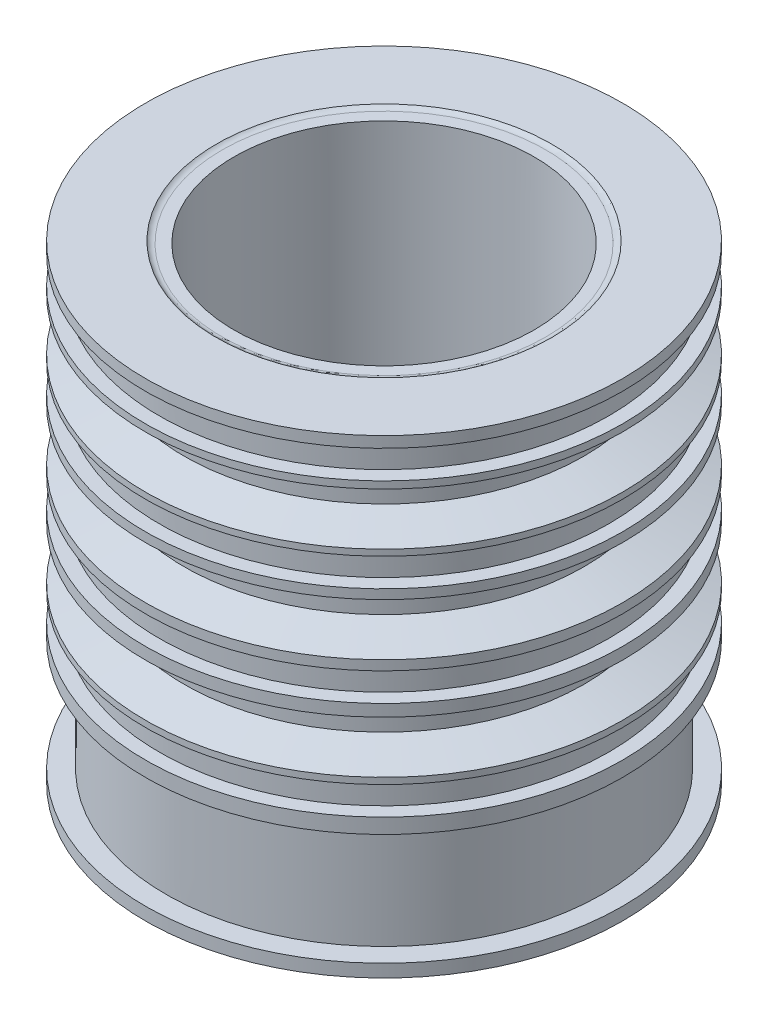
ISO-10303-21;
HEADER;
FILE_DESCRIPTION(('STEP AP214'),'2;1');
FILE_NAME('part.step','',(''),(''),'','','');
FILE_SCHEMA(('AUTOMOTIVE_DESIGN { 1 0 10303 214 1 1 1 1 }'));
ENDSEC;
DATA;
#1=APPLICATION_CONTEXT('core data for automotive mechanical design processes');
#2=APPLICATION_PROTOCOL_DEFINITION('international standard','automotive_design',2000,#1);
#3=PRODUCT_CONTEXT('',#1,'mechanical');
#4=PRODUCT('Part','Part','',(#3));
#5=PRODUCT_RELATED_PRODUCT_CATEGORY('part','',(#4));
#6=PRODUCT_DEFINITION_FORMATION('','',#4);
#7=PRODUCT_DEFINITION_CONTEXT('part definition',#1,'design');
#8=PRODUCT_DEFINITION('design','',#6,#7);
#9=PRODUCT_DEFINITION_SHAPE('','',#8);
#10=(LENGTH_UNIT() NAMED_UNIT(*) SI_UNIT(.MILLI.,.METRE.));
#11=(NAMED_UNIT(*) PLANE_ANGLE_UNIT() SI_UNIT($,.RADIAN.));
#12=(NAMED_UNIT(*) SI_UNIT($,.STERADIAN.) SOLID_ANGLE_UNIT());
#13=UNCERTAINTY_MEASURE_WITH_UNIT(LENGTH_MEASURE(1.E-05),#10,'distance_accuracy_value','');
#14=(GEOMETRIC_REPRESENTATION_CONTEXT(3) GLOBAL_UNCERTAINTY_ASSIGNED_CONTEXT((#13)) GLOBAL_UNIT_ASSIGNED_CONTEXT((#10,
#11,#12)) REPRESENTATION_CONTEXT('',''));
#15=CARTESIAN_POINT('',(0.,0.,0.));
#16=DIRECTION('',(0.,0.,1.));
#17=DIRECTION('',(1.,0.,0.));
#18=AXIS2_PLACEMENT_3D('',#15,#16,#17);
#19=CARTESIAN_POINT('',(-0.0016509550356137,33.7699254257973,0.));
#20=DIRECTION('',(-4.8888323347601E-05,0.999999998804966,0.));
#21=DIRECTION('',(-0.999999998804966,-4.8888323347601E-05,0.));
#22=AXIS2_PLACEMENT_3D('',#19,#20,#21);
#23=CONICAL_SURFACE('',#22,11.6987065389935,1.57074743844616);
#24=CARTESIAN_POINT('',(-0.00165095298483923,33.7698834776525,0.));
#25=DIRECTION('',(4.8888323347601E-05,-0.999999998804966,0.));
#26=DIRECTION('',(0.999999998804966,4.8888323347601E-05,0.));
#27=AXIS2_PLACEMENT_3D('',#24,#25,#26);
#28=CIRCLE('',#27,10.8406668230212);
#29=CARTESIAN_POINT('',(10.8390158570814,33.7704134596774,0.));
#30=VERTEX_POINT('',#29);
#31=EDGE_CURVE('E10',#30,#30,#28,.T.);
#32=ORIENTED_EDGE('',*,*,#31,.T.);
#33=EDGE_LOOP('',(#32));
#34=FACE_BOUND('',#33,.T.);
#35=CARTESIAN_POINT('',(-0.0016509550356137,33.7699254257973,0.));
#36=DIRECTION('',(4.8888323347601E-05,-0.999999998804966,0.));
#37=DIRECTION('',(0.999999998804966,4.8888323347601E-05,0.));
#38=AXIS2_PLACEMENT_3D('',#35,#36,#37);
#39=CIRCLE('',#38,11.6987065389935);
#40=CARTESIAN_POINT('',(11.6970555699776,33.7704973559454,0.));
#41=VERTEX_POINT('',#40);
#42=EDGE_CURVE('E160',#41,#41,#39,.T.);
#43=ORIENTED_EDGE('',*,*,#42,.F.);
#44=EDGE_LOOP('',(#43));
#45=FACE_BOUND('',#44,.T.);
#46=ADVANCED_FACE('F30',(#34,#45),#23,.F.);
#47=CARTESIAN_POINT('',(-0.00165095298483923,33.7698834776525,0.));
#48=DIRECTION('',(4.8888323347601E-05,-0.999999998804966,0.));
#49=DIRECTION('',(0.999999998804966,4.8888323347601E-05,0.));
#50=AXIS2_PLACEMENT_3D('',#47,#48,#49);
#51=CONICAL_SURFACE('',#50,10.8406668230212,4.88883233667293E-05);
#52=CARTESIAN_POINT('',(-0.000477459896761109,9.76633812527663,0.));
#53=DIRECTION('',(4.8888323347601E-05,-0.999999998804966,0.));
#54=DIRECTION('',(0.999999998804966,4.8888323347601E-05,0.));
#55=AXIS2_PLACEMENT_3D('',#52,#53,#54);
#56=CIRCLE('',#55,10.8418403161107);
#57=CARTESIAN_POINT('',(10.8413628432576,9.76686816467169,0.));
#58=VERTEX_POINT('',#57);
#59=EDGE_CURVE('E36',#58,#58,#56,.T.);
#60=ORIENTED_EDGE('',*,*,#59,.T.);
#61=EDGE_LOOP('',(#60));
#62=FACE_BOUND('',#61,.T.);
#63=ORIENTED_EDGE('',*,*,#31,.F.);
#64=EDGE_LOOP('',(#63));
#65=FACE_BOUND('',#64,.T.);
#66=ADVANCED_FACE('F168',(#62,#65),#51,.F.);
#67=CARTESIAN_POINT('',(-0.000463950211009728,9.49000044767884,0.));
#68=DIRECTION('',(4.8888323347601E-05,-0.999999998804966,0.));
#69=DIRECTION('',(0.999999998804966,4.8888323347601E-05,0.));
#70=AXIS2_PLACEMENT_3D('',#67,#68,#69);
#71=TOROIDAL_SURFACE('',#70,10.2632570925746,0.641187226011283);
#72=CARTESIAN_POINT('',(-0.000455579930538189,9.31878818495237,0.));
#73=DIRECTION('',(4.8888323347601E-05,-0.999999998804966,0.));
#74=DIRECTION('',(0.999999998804966,4.8888323347601E-05,0.));
#75=AXIS2_PLACEMENT_3D('',#72,#73,#74);
#76=CIRCLE('',#75,10.8811627648435);
#77=CARTESIAN_POINT('',(10.8807071719096,9.31932014675602,0.));
#78=VERTEX_POINT('',#77);
#79=EDGE_CURVE('E40',#78,#78,#76,.T.);
#80=ORIENTED_EDGE('',*,*,#79,.T.);
#81=EDGE_LOOP('',(#80));
#82=FACE_BOUND('',#81,.T.);
#83=ORIENTED_EDGE('',*,*,#59,.F.);
#84=EDGE_LOOP('',(#83));
#85=FACE_BOUND('',#84,.T.);
#86=ADVANCED_FACE('F172',(#82,#85),#71,.F.);
#87=CARTESIAN_POINT('',(-0.000455579930538189,9.31878818495237,0.));
#88=DIRECTION('',(-4.8888323347601E-05,0.999999998804966,0.));
#89=DIRECTION('',(-0.999999998804966,-4.8888323347601E-05,0.));
#90=AXIS2_PLACEMENT_3D('',#87,#88,#89);
#91=CONICAL_SURFACE('',#90,10.8811627648435,0.000755615516415063);
#92=CARTESIAN_POINT('',(-0.000348856109653507,7.13577568934424,0.));
#93=DIRECTION('',(4.8888323347601E-05,-0.999999998804966,0.));
#94=DIRECTION('',(0.999999998804966,4.8888323347601E-05,0.));
#95=AXIS2_PLACEMENT_3D('',#92,#93,#94);
#96=CIRCLE('',#95,10.8795132464134);
#97=CARTESIAN_POINT('',(10.8791643773024,7.1363075705057,0.));
#98=VERTEX_POINT('',#97);
#99=EDGE_CURVE('E44',#98,#98,#96,.T.);
#100=ORIENTED_EDGE('',*,*,#99,.T.);
#101=EDGE_LOOP('',(#100));
#102=FACE_BOUND('',#101,.T.);
#103=ORIENTED_EDGE('',*,*,#79,.F.);
#104=EDGE_LOOP('',(#103));
#105=FACE_BOUND('',#104,.T.);
#106=ADVANCED_FACE('F176',(#102,#105),#91,.F.);
#107=CARTESIAN_POINT('',(-0.000348856109653507,7.13577568934424,0.));
#108=DIRECTION('',(4.8888323347601E-05,-0.999999998804966,0.));
#109=DIRECTION('',(0.999999998804966,4.8888323347601E-05,0.));
#110=AXIS2_PLACEMENT_3D('',#107,#108,#109);
#111=CONICAL_SURFACE('',#110,10.8795132464134,1.41021445256014);
#112=CARTESIAN_POINT('',(-0.00033397194410014,6.83132332697231,0.));
#113=DIRECTION('',(4.8888323347601E-05,-0.999999998804966,0.));
#114=DIRECTION('',(0.999999998804966,4.8888323347601E-05,0.));
#115=AXIS2_PLACEMENT_3D('',#112,#113,#114);
#116=CIRCLE('',#115,12.7591209553291);
#117=CARTESIAN_POINT('',(12.7587869681374,6.8319470990032,0.));
#118=VERTEX_POINT('',#117);
#119=EDGE_CURVE('E49',#118,#118,#116,.T.);
#120=ORIENTED_EDGE('',*,*,#119,.T.);
#121=EDGE_LOOP('',(#120));
#122=FACE_BOUND('',#121,.T.);
#123=ORIENTED_EDGE('',*,*,#99,.F.);
#124=EDGE_LOOP('',(#123));
#125=FACE_BOUND('',#124,.T.);
#126=ADVANCED_FACE('F183',(#122,#125),#111,.F.);
#127=CARTESIAN_POINT('',(-0.00033397194410014,6.83132332697231,0.));
#128=DIRECTION('',(4.8888323347601E-05,-0.999999998804966,0.));
#129=DIRECTION('',(0.999999998804966,4.8888323347601E-05,0.));
#130=AXIS2_PLACEMENT_3D('',#127,#128,#129);
#131=CONICAL_SURFACE('',#130,12.7591209553291,4.88883180863904E-05);
#132=CARTESIAN_POINT('',(0.,-3.64228613807057E-13,0.));
#133=DIRECTION('',(4.8888323347601E-05,-0.999999998804966,0.));
#134=DIRECTION('',(0.999999998804966,4.8888323347601E-05,0.));
#135=AXIS2_PLACEMENT_3D('',#132,#133,#134);
#136=CIRCLE('',#135,12.7594549272375);
#137=CARTESIAN_POINT('',(12.7594549119895,0.000623788357857698,0.));
#138=VERTEX_POINT('',#137);
#139=EDGE_CURVE('E52',#138,#138,#136,.T.);
#140=ORIENTED_EDGE('',*,*,#139,.T.);
#141=EDGE_LOOP('',(#140));
#142=FACE_BOUND('',#141,.T.);
#143=ORIENTED_EDGE('',*,*,#119,.F.);
#144=EDGE_LOOP('',(#143));
#145=FACE_BOUND('',#144,.T.);
#146=ADVANCED_FACE('F187',(#142,#145),#131,.F.);
#147=CARTESIAN_POINT('',(0.,-3.64228613807057E-13,0.));
#148=DIRECTION('',(-4.8888323347601E-05,0.999999998804966,0.));
#149=DIRECTION('',(-0.999999998804966,-4.8888323347601E-05,0.));
#150=AXIS2_PLACEMENT_3D('',#147,#148,#149);
#151=CONICAL_SURFACE('',#150,12.7594549272375,1.57074743846375);
#152=CARTESIAN_POINT('',(-1.07049960643249E-08,0.000218968361328704,0.));
#153=DIRECTION('',(4.8888323347601E-05,-0.999999998804966,0.));
#154=DIRECTION('',(0.999999998804966,4.8888323347601E-05,0.));
#155=AXIS2_PLACEMENT_3D('',#152,#153,#154);
#156=CIRCLE('',#155,17.2384043334826);
#157=CARTESIAN_POINT('',(17.2384043021772,0.00106172504638069,0.));
#158=VERTEX_POINT('',#157);
#159=EDGE_CURVE('E55',#158,#158,#156,.T.);
#160=ORIENTED_EDGE('',*,*,#159,.T.);
#161=EDGE_LOOP('',(#160));
#162=FACE_BOUND('',#161,.T.);
#163=ORIENTED_EDGE('',*,*,#139,.F.);
#164=EDGE_LOOP('',(#163));
#165=FACE_BOUND('',#164,.T.);
#166=ADVANCED_FACE('F191',(#162,#165),#151,.T.);
#167=CARTESIAN_POINT('',(-1.07049960643249E-08,0.000218968361328704,0.));
#168=DIRECTION('',(4.8888323347601E-05,-0.999999998804966,0.));
#169=DIRECTION('',(0.999999998804966,4.8888323347601E-05,0.));
#170=AXIS2_PLACEMENT_3D('',#167,#168,#169);
#171=CONICAL_SURFACE('',#170,17.2384043334826,4.88883585371672E-05);
#172=CARTESIAN_POINT('',(-4.53166192771179E-05,0.926941570500528,0.));
#173=DIRECTION('',(4.8888323347601E-05,-0.999999998804966,0.));
#174=DIRECTION('',(0.999999998804966,4.8888323347601E-05,0.));
#175=AXIS2_PLACEMENT_3D('',#172,#173,#174);
#176=CIRCLE('',#175,17.2383590275357);
#177=CARTESIAN_POINT('',(17.238313690316,0.927784324970649,0.));
#178=VERTEX_POINT('',#177);
#179=EDGE_CURVE('E58',#178,#178,#176,.T.);
#180=ORIENTED_EDGE('',*,*,#179,.T.);
#181=EDGE_LOOP('',(#180));
#182=FACE_BOUND('',#181,.T.);
#183=ORIENTED_EDGE('',*,*,#159,.F.);
#184=EDGE_LOOP('',(#183));
#185=FACE_BOUND('',#184,.T.);
#186=ADVANCED_FACE('F195',(#182,#185),#171,.T.);
#187=CARTESIAN_POINT('',(-4.53166192771179E-05,0.926941570500528,0.));
#188=DIRECTION('',(-4.8888323347601E-05,0.999999998804966,0.));
#189=DIRECTION('',(-0.999999998804966,-4.8888323347601E-05,0.));
#190=AXIS2_PLACEMENT_3D('',#187,#188,#189);
#191=CONICAL_SURFACE('',#190,17.2383590275357,1.57074743846887);
#192=CARTESIAN_POINT('',(-4.53130823744777E-05,0.926869223927896,0.));
#193=DIRECTION('',(4.8888323347601E-05,-0.999999998804966,0.));
#194=DIRECTION('',(0.999999998804966,4.8888323347601E-05,0.));
#195=AXIS2_PLACEMENT_3D('',#192,#193,#194);
#196=CIRCLE('',#195,15.7585257310919);
#197=CARTESIAN_POINT('',(15.7584803991775,0.927639631829319,0.));
#198=VERTEX_POINT('',#197);
#199=EDGE_CURVE('E61',#198,#198,#196,.T.);
#200=ORIENTED_EDGE('',*,*,#199,.T.);
#201=EDGE_LOOP('',(#200));
#202=FACE_BOUND('',#201,.T.);
#203=ORIENTED_EDGE('',*,*,#179,.F.);
#204=EDGE_LOOP('',(#203));
#205=FACE_BOUND('',#204,.T.);
#206=ADVANCED_FACE('F199',(#202,#205),#191,.F.);
#207=CARTESIAN_POINT('',(-4.53130823744777E-05,0.926869223927896,0.));
#208=DIRECTION('',(-4.8888323347601E-05,0.999999998804966,0.));
#209=DIRECTION('',(-0.999999998804966,-4.8888323347601E-05,0.));
#210=AXIS2_PLACEMENT_3D('',#207,#208,#209);
#211=CONICAL_SURFACE('',#210,15.7585257310919,0.000561303075088053);
#212=CARTESIAN_POINT('',(-0.000439011716176201,8.97988897124061,0.));
#213=DIRECTION('',(4.8888323347601E-05,-0.999999998804966,0.));
#214=DIRECTION('',(0.999999998804966,4.8888323347601E-05,0.));
#215=AXIS2_PLACEMENT_3D('',#212,#213,#214);
#216=CIRCLE('',#215,15.7630459163199);
#217=CARTESIAN_POINT('',(15.7626068857663,8.98065960012631,0.));
#218=VERTEX_POINT('',#217);
#219=EDGE_CURVE('E64',#218,#218,#216,.T.);
#220=ORIENTED_EDGE('',*,*,#219,.T.);
#221=EDGE_LOOP('',(#220));
#222=FACE_BOUND('',#221,.T.);
#223=ORIENTED_EDGE('',*,*,#199,.F.);
#224=EDGE_LOOP('',(#223));
#225=FACE_BOUND('',#224,.T.);
#226=ADVANCED_FACE('F203',(#222,#225),#211,.T.);
#227=CARTESIAN_POINT('',(-0.000439011716176201,8.97988897124061,0.));
#228=DIRECTION('',(-4.8888323347601E-05,0.999999998804966,0.));
#229=DIRECTION('',(-0.999999998804966,-4.8888323347601E-05,0.));
#230=AXIS2_PLACEMENT_3D('',#227,#228,#229);
#231=CONICAL_SURFACE('',#230,15.7630459163199,1.5707474385034);
#232=CARTESIAN_POINT('',(-0.000439015241331834,8.97996107753077,0.));
#233=DIRECTION('',(4.8888323347601E-05,-0.999999998804966,0.));
#234=DIRECTION('',(0.999999998804966,4.8888323347601E-05,0.));
#235=AXIS2_PLACEMENT_3D('',#232,#233,#234);
#236=CIRCLE('',#235,17.2379653289458);
#237=CARTESIAN_POINT('',(17.2375262931045,8.98080381275362,0.));
#238=VERTEX_POINT('',#237);
#239=EDGE_CURVE('E67',#238,#238,#236,.T.);
#240=ORIENTED_EDGE('',*,*,#239,.T.);
#241=EDGE_LOOP('',(#240));
#242=FACE_BOUND('',#241,.T.);
#243=ORIENTED_EDGE('',*,*,#219,.F.);
#244=EDGE_LOOP('',(#243));
#245=FACE_BOUND('',#244,.T.);
#246=ADVANCED_FACE('F207',(#242,#245),#231,.T.);
#247=CARTESIAN_POINT('',(-0.000439015241331834,8.97996107753077,0.));
#248=DIRECTION('',(4.8888323347601E-05,-0.999999998804966,0.));
#249=DIRECTION('',(0.999999998804966,4.8888323347601E-05,0.));
#250=AXIS2_PLACEMENT_3D('',#247,#248,#249);
#251=CONICAL_SURFACE('',#250,17.2379653289458,4.88884486765176E-05);
#252=CARTESIAN_POINT('',(-0.000492154887899934,10.0669209662299,0.));
#253=DIRECTION('',(4.8888323347601E-05,-0.999999998804966,0.));
#254=DIRECTION('',(0.999999998804966,4.8888323347601E-05,0.));
#255=AXIS2_PLACEMENT_3D('',#252,#253,#254);
#256=CIRCLE('',#255,17.2379121891629);
#257=CARTESIAN_POINT('',(17.2374200136751,10.0677636988548,0.));
#258=VERTEX_POINT('',#257);
#259=EDGE_CURVE('E70',#258,#258,#256,.T.);
#260=ORIENTED_EDGE('',*,*,#259,.T.);
#261=EDGE_LOOP('',(#260));
#262=FACE_BOUND('',#261,.T.);
#263=ORIENTED_EDGE('',*,*,#239,.F.);
#264=EDGE_LOOP('',(#263));
#265=FACE_BOUND('',#264,.T.);
#266=ADVANCED_FACE('F211',(#262,#265),#251,.T.);
#267=CARTESIAN_POINT('',(-0.000492154887899934,10.0669209662299,0.));
#268=DIRECTION('',(-4.8888323347601E-05,0.999999998804966,0.));
#269=DIRECTION('',(-0.999999998804966,-4.8888323347601E-05,0.));
#270=AXIS2_PLACEMENT_3D('',#267,#268,#269);
#271=CONICAL_SURFACE('',#270,17.2379121891629,1.5707474385081);
#272=CARTESIAN_POINT('',(-0.000492152507184025,10.0668722692049,0.));
#273=DIRECTION('',(4.8888323347601E-05,-0.999999998804966,0.));
#274=DIRECTION('',(0.999999998804966,4.8888323347601E-05,0.));
#275=AXIS2_PLACEMENT_3D('',#272,#273,#274);
#276=CIRCLE('',#275,16.241824409583);
#277=CARTESIAN_POINT('',(16.2413322376663,10.0676663047684,0.));
#278=VERTEX_POINT('',#277);
#279=EDGE_CURVE('E73',#278,#278,#276,.T.);
#280=ORIENTED_EDGE('',*,*,#279,.T.);
#281=EDGE_LOOP('',(#280));
#282=FACE_BOUND('',#281,.T.);
#283=ORIENTED_EDGE('',*,*,#259,.F.);
#284=EDGE_LOOP('',(#283));
#285=FACE_BOUND('',#284,.T.);
#286=ADVANCED_FACE('F215',(#282,#285),#271,.F.);
#287=CARTESIAN_POINT('',(-0.000492152507184025,10.0668722692049,0.));
#288=DIRECTION('',(4.8888323347601E-05,-0.999999998804966,0.));
#289=DIRECTION('',(0.999999998804966,4.8888323347601E-05,0.));
#290=AXIS2_PLACEMENT_3D('',#287,#288,#289);
#291=CONICAL_SURFACE('',#290,16.241824409583,4.88883417639845E-05);
#292=CARTESIAN_POINT('',(-0.000591694588467061,12.1029838465303,0.));
#293=DIRECTION('',(4.8888323347601E-05,-0.999999998804966,0.));
#294=DIRECTION('',(0.999999998804966,4.8888323347601E-05,0.));
#295=AXIS2_PLACEMENT_3D('',#292,#293,#294);
#296=CIRCLE('',#295,16.2417248674642);
#297=CARTESIAN_POINT('',(16.2411331534663,12.1037778772274,0.));
#298=VERTEX_POINT('',#297);
#299=EDGE_CURVE('E76',#298,#298,#296,.T.);
#300=ORIENTED_EDGE('',*,*,#299,.T.);
#301=EDGE_LOOP('',(#300));
#302=FACE_BOUND('',#301,.T.);
#303=ORIENTED_EDGE('',*,*,#279,.F.);
#304=EDGE_LOOP('',(#303));
#305=FACE_BOUND('',#304,.T.);
#306=ADVANCED_FACE('F219',(#302,#305),#291,.T.);
#307=CARTESIAN_POINT('',(-0.000591694588467061,12.1029838465303,0.));
#308=DIRECTION('',(-4.8888323347601E-05,0.999999998804966,0.));
#309=DIRECTION('',(-0.999999998804966,-4.8888323347601E-05,0.));
#310=AXIS2_PLACEMENT_3D('',#307,#308,#309);
#311=CONICAL_SURFACE('',#310,16.2417248674642,1.57074743844369);
#312=CARTESIAN_POINT('',(-0.000591696969186106,12.1030325436195,0.));
#313=DIRECTION('',(4.8888323347601E-05,-0.999999998804966,0.));
#314=DIRECTION('',(0.999999998804966,4.8888323347601E-05,0.));
#315=AXIS2_PLACEMENT_3D('',#312,#313,#314);
#316=CIRCLE('',#315,17.2378126472177);
#317=CARTESIAN_POINT('',(17.2372209296488,12.103875271378,0.));
#318=VERTEX_POINT('',#317);
#319=EDGE_CURVE('E79',#318,#318,#316,.T.);
#320=ORIENTED_EDGE('',*,*,#319,.T.);
#321=EDGE_LOOP('',(#320));
#322=FACE_BOUND('',#321,.T.);
#323=ORIENTED_EDGE('',*,*,#299,.F.);
#324=EDGE_LOOP('',(#323));
#325=FACE_BOUND('',#324,.T.);
#326=ADVANCED_FACE('F223',(#322,#325),#311,.T.);
#327=CARTESIAN_POINT('',(-0.000591696969186106,12.1030325436195,0.));
#328=DIRECTION('',(4.8888323347601E-05,-0.999999998804966,0.));
#329=DIRECTION('',(0.999999998804966,4.8888323347601E-05,0.));
#330=AXIS2_PLACEMENT_3D('',#327,#328,#329);
#331=CONICAL_SURFACE('',#330,17.2378126472177,4.88883233939905E-05);
#332=CARTESIAN_POINT('',(-0.000613910174311488,12.5573988130638,0.));
#333=DIRECTION('',(4.8888323347601E-05,-0.999999998804966,0.));
#334=DIRECTION('',(0.999999998804966,4.8888323347601E-05,0.));
#335=AXIS2_PLACEMENT_3D('',#332,#333,#334);
#336=CIRCLE('',#335,17.2377904340126);
#337=CARTESIAN_POINT('',(17.2371765032385,12.5582415397363,0.));
#338=VERTEX_POINT('',#337);
#339=EDGE_CURVE('E82',#338,#338,#336,.T.);
#340=ORIENTED_EDGE('',*,*,#339,.T.);
#341=EDGE_LOOP('',(#340));
#342=FACE_BOUND('',#341,.T.);
#343=ORIENTED_EDGE('',*,*,#319,.F.);
#344=EDGE_LOOP('',(#343));
#345=FACE_BOUND('',#344,.T.);
#346=ADVANCED_FACE('F227',(#342,#345),#331,.T.);
#347=CARTESIAN_POINT('',(-0.000613910174311488,12.5573988130638,0.));
#348=DIRECTION('',(4.8888323347601E-05,-0.999999998804966,0.));
#349=DIRECTION('',(0.999999998804966,4.8888323347601E-05,0.));
#350=AXIS2_PLACEMENT_3D('',#347,#348,#349);
#351=CONICAL_SURFACE('',#350,17.2377904340126,1.27649281216267);
#352=CARTESIAN_POINT('',(-0.000655330291129579,13.4046382750124,0.));
#353=DIRECTION('',(4.8888323347601E-05,-0.999999998804966,0.));
#354=DIRECTION('',(0.999999998804966,4.8888323347601E-05,0.));
#355=AXIS2_PLACEMENT_3D('',#352,#353,#354);
#356=CIRCLE('',#355,14.4425946234579);
#357=CARTESIAN_POINT('',(14.4419392759074,13.4053443492484,0.));
#358=VERTEX_POINT('',#357);
#359=EDGE_CURVE('E85',#358,#358,#356,.T.);
#360=ORIENTED_EDGE('',*,*,#359,.T.);
#361=EDGE_LOOP('',(#360));
#362=FACE_BOUND('',#361,.T.);
#363=ORIENTED_EDGE('',*,*,#339,.F.);
#364=EDGE_LOOP('',(#363));
#365=FACE_BOUND('',#364,.T.);
#366=ADVANCED_FACE('F231',(#362,#365),#351,.T.);
#367=CARTESIAN_POINT('',(-0.000655330291129579,13.4046382750124,0.));
#368=DIRECTION('',(4.8888323347601E-05,-0.999999998804966,0.));
#369=DIRECTION('',(0.999999998804966,4.8888323347601E-05,0.));
#370=AXIS2_PLACEMENT_3D('',#367,#368,#369);
#371=CONICAL_SURFACE('',#370,14.4425946234579,4.88883233721781E-05);
#372=CARTESIAN_POINT('',(-0.00075734287073471,15.4912833570682,0.));
#373=DIRECTION('',(4.8888323347601E-05,-0.999999998804966,0.));
#374=DIRECTION('',(0.999999998804966,4.8888323347601E-05,0.));
#375=AXIS2_PLACEMENT_3D('',#372,#373,#374);
#376=CIRCLE('',#375,14.4424926108782);
#377=CARTESIAN_POINT('',(14.4417352507482,15.4919894263169,0.));
#378=VERTEX_POINT('',#377);
#379=EDGE_CURVE('E88',#378,#378,#376,.T.);
#380=ORIENTED_EDGE('',*,*,#379,.T.);
#381=EDGE_LOOP('',(#380));
#382=FACE_BOUND('',#381,.T.);
#383=ORIENTED_EDGE('',*,*,#359,.F.);
#384=EDGE_LOOP('',(#383));
#385=FACE_BOUND('',#384,.T.);
#386=ADVANCED_FACE('F235',(#382,#385),#371,.T.);
#387=CARTESIAN_POINT('',(-0.00075734287073471,15.4912833570682,0.));
#388=DIRECTION('',(-4.8888323347601E-05,0.999999998804966,0.));
#389=DIRECTION('',(-0.999999998804966,-4.8888323347601E-05,0.));
#390=AXIS2_PLACEMENT_3D('',#387,#388,#389);
#391=CONICAL_SURFACE('',#390,14.4424926108782,1.283621048092);
#392=CARTESIAN_POINT('',(-0.000797700498440245,16.3167898357903,0.));
#393=DIRECTION('',(4.8888323347601E-05,-0.999999998804966,0.));
#394=DIRECTION('',(0.999999998804966,4.8888323347601E-05,0.));
#395=AXIS2_PLACEMENT_3D('',#392,#393,#394);
#396=CIRCLE('',#395,17.2376066436882);
#397=CARTESIAN_POINT('',(17.2368089225903,16.3176325534776,0.));
#398=VERTEX_POINT('',#397);
#399=EDGE_CURVE('E91',#398,#398,#396,.T.);
#400=ORIENTED_EDGE('',*,*,#399,.T.);
#401=EDGE_LOOP('',(#400));
#402=FACE_BOUND('',#401,.T.);
#403=ORIENTED_EDGE('',*,*,#379,.F.);
#404=EDGE_LOOP('',(#403));
#405=FACE_BOUND('',#404,.T.);
#406=ADVANCED_FACE('F239',(#402,#405),#391,.T.);
#407=CARTESIAN_POINT('',(-0.000797700498440245,16.3167898357903,0.));
#408=DIRECTION('',(4.8888323347601E-05,-0.999999998804966,0.));
#409=DIRECTION('',(0.999999998804966,4.8888323347601E-05,0.));
#410=AXIS2_PLACEMENT_3D('',#407,#408,#409);
#411=CONICAL_SURFACE('',#410,17.2376066436882,4.88882924667056E-05);
#412=CARTESIAN_POINT('',(-0.000839794442524566,17.1778122876082,0.));
#413=DIRECTION('',(4.8888323347601E-05,-0.999999998804966,0.));
#414=DIRECTION('',(0.999999998804966,4.8888323347601E-05,0.));
#415=AXIS2_PLACEMENT_3D('',#412,#413,#414);
#416=CIRCLE('',#415,17.2375645497707);
#417=CARTESIAN_POINT('',(17.2367247347287,17.1786550032376,0.));
#418=VERTEX_POINT('',#417);
#419=EDGE_CURVE('E94',#418,#418,#416,.T.);
#420=ORIENTED_EDGE('',*,*,#419,.T.);
#421=EDGE_LOOP('',(#420));
#422=FACE_BOUND('',#421,.T.);
#423=ORIENTED_EDGE('',*,*,#399,.F.);
#424=EDGE_LOOP('',(#423));
#425=FACE_BOUND('',#424,.T.);
#426=ADVANCED_FACE('F243',(#422,#425),#411,.T.);
#427=CARTESIAN_POINT('',(-0.000839794442524566,17.1778122876082,0.));
#428=DIRECTION('',(-4.8888323347601E-05,0.999999998804966,0.));
#429=DIRECTION('',(-0.999999998804966,-4.8888323347601E-05,0.));
#430=AXIS2_PLACEMENT_3D('',#427,#428,#429);
#431=CONICAL_SURFACE('',#430,17.2375645497707,1.57074743850745);
#432=CARTESIAN_POINT('',(-0.000839792061808626,17.1777635905825,0.));
#433=DIRECTION('',(4.8888323347601E-05,-0.999999998804966,0.));
#434=DIRECTION('',(0.999999998804966,4.8888323347601E-05,0.));
#435=AXIS2_PLACEMENT_3D('',#432,#433,#434);
#436=CIRCLE('',#435,16.2414767700011);
#437=CARTESIAN_POINT('',(16.2406369585301,17.1785576091505,0.));
#438=VERTEX_POINT('',#437);
#439=EDGE_CURVE('E97',#438,#438,#436,.T.);
#440=ORIENTED_EDGE('',*,*,#439,.T.);
#441=EDGE_LOOP('',(#440));
#442=FACE_BOUND('',#441,.T.);
#443=ORIENTED_EDGE('',*,*,#419,.F.);
#444=EDGE_LOOP('',(#443));
#445=FACE_BOUND('',#444,.T.);
#446=ADVANCED_FACE('F247',(#442,#445),#431,.F.);
#447=CARTESIAN_POINT('',(-0.000839792061808626,17.1777635905825,0.));
#448=DIRECTION('',(4.8888323347601E-05,-0.999999998804966,0.));
#449=DIRECTION('',(0.999999998804966,4.8888323347601E-05,0.));
#450=AXIS2_PLACEMENT_3D('',#447,#448,#449);
#451=CONICAL_SURFACE('',#450,16.2414767700011,4.88882619131264E-05);
#452=CARTESIAN_POINT('',(-0.000939334143091696,19.2138751679086,0.));
#453=DIRECTION('',(4.8888323347601E-05,-0.999999998804966,0.));
#454=DIRECTION('',(0.999999998804966,4.8888323347601E-05,0.));
#455=AXIS2_PLACEMENT_3D('',#452,#453,#454);
#456=CIRCLE('',#455,16.2413772280448);
#457=CARTESIAN_POINT('',(16.2404378744927,19.2146691816102,0.));
#458=VERTEX_POINT('',#457);
#459=EDGE_CURVE('E100',#458,#458,#456,.T.);
#460=ORIENTED_EDGE('',*,*,#459,.T.);
#461=EDGE_LOOP('',(#460));
#462=FACE_BOUND('',#461,.T.);
#463=ORIENTED_EDGE('',*,*,#439,.F.);
#464=EDGE_LOOP('',(#463));
#465=FACE_BOUND('',#464,.T.);
#466=ADVANCED_FACE('F251',(#462,#465),#451,.T.);
#467=CARTESIAN_POINT('',(-0.000939334143091696,19.2138751679086,0.));
#468=DIRECTION('',(-4.8888323347601E-05,0.999999998804966,0.));
#469=DIRECTION('',(-0.999999998804966,-4.8888323347601E-05,0.));
#470=AXIS2_PLACEMENT_3D('',#467,#468,#469);
#471=CONICAL_SURFACE('',#470,16.2413772280448,1.57074743850143);
#472=CARTESIAN_POINT('',(-0.000939336523807929,19.2139238649403,0.));
#473=DIRECTION('',(4.8888323347601E-05,-0.999999998804966,0.));
#474=DIRECTION('',(0.999999998804966,4.8888323347601E-05,0.));
#475=AXIS2_PLACEMENT_3D('',#472,#473,#474);
#476=CIRCLE('',#475,17.2374650076627);
#477=CARTESIAN_POINT('',(17.2365256505395,19.2147665757033,0.));
#478=VERTEX_POINT('',#477);
#479=EDGE_CURVE('E103',#478,#478,#476,.T.);
#480=ORIENTED_EDGE('',*,*,#479,.T.);
#481=EDGE_LOOP('',(#480));
#482=FACE_BOUND('',#481,.T.);
#483=ORIENTED_EDGE('',*,*,#459,.F.);
#484=EDGE_LOOP('',(#483));
#485=FACE_BOUND('',#484,.T.);
#486=ADVANCED_FACE('F255',(#482,#485),#471,.T.);
#487=CARTESIAN_POINT('',(-0.000939336523807929,19.2139238649403,0.));
#488=DIRECTION('',(4.8888323347601E-05,-0.999999998804966,0.));
#489=DIRECTION('',(0.999999998804966,4.8888323347601E-05,0.));
#490=AXIS2_PLACEMENT_3D('',#487,#488,#489);
#491=CONICAL_SURFACE('',#490,17.2374650076627,4.88883233867888E-05);
#492=CARTESIAN_POINT('',(-0.0009734400049383,19.9115031385664,0.));
#493=DIRECTION('',(4.8888323347601E-05,-0.999999998804966,0.));
#494=DIRECTION('',(0.999999998804966,4.8888323347601E-05,0.));
#495=AXIS2_PLACEMENT_3D('',#492,#493,#494);
#496=CIRCLE('',#495,17.2374309041815);
#497=CARTESIAN_POINT('',(17.2364574435773,19.9123458476621,0.));
#498=VERTEX_POINT('',#497);
#499=EDGE_CURVE('E106',#498,#498,#496,.T.);
#500=ORIENTED_EDGE('',*,*,#499,.T.);
#501=EDGE_LOOP('',(#500));
#502=FACE_BOUND('',#501,.T.);
#503=ORIENTED_EDGE('',*,*,#479,.F.);
#504=EDGE_LOOP('',(#503));
#505=FACE_BOUND('',#504,.T.);
#506=ADVANCED_FACE('F259',(#502,#505),#491,.T.);
#507=CARTESIAN_POINT('',(-0.0009734400049383,19.9115031385664,0.));
#508=DIRECTION('',(4.8888323347601E-05,-0.999999998804966,0.));
#509=DIRECTION('',(0.999999998804966,4.8888323347601E-05,0.));
#510=AXIS2_PLACEMENT_3D('',#507,#508,#509);
#511=CONICAL_SURFACE('',#510,17.2374309041815,1.27649281215867);
#512=CARTESIAN_POINT('',(-0.00101486012175691,20.7587426005256,0.));
#513=DIRECTION('',(4.8888323347601E-05,-0.999999998804966,0.));
#514=DIRECTION('',(0.999999998804966,4.8888323347601E-05,0.));
#515=AXIS2_PLACEMENT_3D('',#512,#513,#514);
#516=CIRCLE('',#515,14.442235093632);
#517=CARTESIAN_POINT('',(14.4412202162513,20.7594486571848,0.));
#518=VERTEX_POINT('',#517);
#519=EDGE_CURVE('E109',#518,#518,#516,.T.);
#520=ORIENTED_EDGE('',*,*,#519,.T.);
#521=EDGE_LOOP('',(#520));
#522=FACE_BOUND('',#521,.T.);
#523=ORIENTED_EDGE('',*,*,#499,.F.);
#524=EDGE_LOOP('',(#523));
#525=FACE_BOUND('',#524,.T.);
#526=ADVANCED_FACE('F263',(#522,#525),#511,.T.);
#527=CARTESIAN_POINT('',(-0.00101486012175691,20.7587426005256,0.));
#528=DIRECTION('',(4.8888323347601E-05,-0.999999998804966,0.));
#529=DIRECTION('',(0.999999998804966,4.8888323347601E-05,0.));
#530=AXIS2_PLACEMENT_3D('',#527,#528,#529);
#531=CONICAL_SURFACE('',#530,14.442235093632,4.88883233657418E-05);
#532=CARTESIAN_POINT('',(-0.00111687270136159,22.8453876825722,0.));
#533=DIRECTION('',(4.8888323347601E-05,-0.999999998804966,0.));
#534=DIRECTION('',(0.999999998804966,4.8888323347601E-05,0.));
#535=AXIS2_PLACEMENT_3D('',#532,#533,#534);
#536=CIRCLE('',#535,14.4421330810523);
#537=CARTESIAN_POINT('',(14.4410161910921,22.8460937342441,0.));
#538=VERTEX_POINT('',#537);
#539=EDGE_CURVE('E112',#538,#538,#536,.T.);
#540=ORIENTED_EDGE('',*,*,#539,.T.);
#541=EDGE_LOOP('',(#540));
#542=FACE_BOUND('',#541,.T.);
#543=ORIENTED_EDGE('',*,*,#519,.F.);
#544=EDGE_LOOP('',(#543));
#545=FACE_BOUND('',#544,.T.);
#546=ADVANCED_FACE('F267',(#542,#545),#531,.T.);
#547=CARTESIAN_POINT('',(-0.00111687270136159,22.8453876825722,0.));
#548=DIRECTION('',(-4.8888323347601E-05,0.999999998804966,0.));
#549=DIRECTION('',(-0.999999998804966,-4.8888323347601E-05,0.));
#550=AXIS2_PLACEMENT_3D('',#547,#548,#549);
#551=CONICAL_SURFACE('',#550,14.4421330810523,1.28362104810668);
#552=CARTESIAN_POINT('',(-0.00115723032906487,23.6708941612482,0.));
#553=DIRECTION('',(4.8888323347601E-05,-0.999999998804966,0.));
#554=DIRECTION('',(0.999999998804966,4.8888323347601E-05,0.));
#555=AXIS2_PLACEMENT_3D('',#552,#553,#554);
#556=CIRCLE('',#555,17.2372471138572);
#557=CARTESIAN_POINT('',(17.236089862929,23.6717368613587,0.));
#558=VERTEX_POINT('',#557);
#559=EDGE_CURVE('E115',#558,#558,#556,.T.);
#560=ORIENTED_EDGE('',*,*,#559,.T.);
#561=EDGE_LOOP('',(#560));
#562=FACE_BOUND('',#561,.T.);
#563=ORIENTED_EDGE('',*,*,#539,.F.);
#564=EDGE_LOOP('',(#563));
#565=FACE_BOUND('',#564,.T.);
#566=ADVANCED_FACE('F271',(#562,#565),#551,.T.);
#567=CARTESIAN_POINT('',(-0.00115723032906487,23.6708941612482,0.));
#568=DIRECTION('',(4.8888323347601E-05,-0.999999998804966,0.));
#569=DIRECTION('',(0.999999998804966,4.8888323347601E-05,0.));
#570=AXIS2_PLACEMENT_3D('',#567,#568,#569);
#571=CONICAL_SURFACE('',#570,17.2372471138572,4.88881361216623E-05);
#572=CARTESIAN_POINT('',(-0.00119032719610557,24.3478833630627,0.));
#573=DIRECTION('',(4.8888323347601E-05,-0.999999998804966,0.));
#574=DIRECTION('',(0.999999998804966,4.8888323347601E-05,0.));
#575=AXIS2_PLACEMENT_3D('',#572,#573,#574);
#576=CIRCLE('',#575,17.2372140171169);
#577=CARTESIAN_POINT('',(17.2360236693217,24.3487260615552,0.));
#578=VERTEX_POINT('',#577);
#579=EDGE_CURVE('E118',#578,#578,#576,.T.);
#580=ORIENTED_EDGE('',*,*,#579,.T.);
#581=EDGE_LOOP('',(#580));
#582=FACE_BOUND('',#581,.T.);
#583=ORIENTED_EDGE('',*,*,#559,.F.);
#584=EDGE_LOOP('',(#583));
#585=FACE_BOUND('',#584,.T.);
#586=ADVANCED_FACE('F275',(#582,#585),#571,.T.);
#587=CARTESIAN_POINT('',(-0.00119032719610557,24.3478833630627,0.));
#588=DIRECTION('',(-4.8888323347601E-05,0.999999998804966,0.));
#589=DIRECTION('',(-0.999999998804966,-4.8888323347601E-05,0.));
#590=AXIS2_PLACEMENT_3D('',#587,#588,#589);
#591=CONICAL_SURFACE('',#590,17.2372140171169,1.57074743847757);
#592=CARTESIAN_POINT('',(-0.00119032481538817,24.3478346660073,0.));
#593=DIRECTION('',(4.8888323347601E-05,-0.999999998804966,0.));
#594=DIRECTION('',(0.999999998804966,4.8888323347601E-05,0.));
#595=AXIS2_PLACEMENT_3D('',#592,#593,#594);
#596=CIRCLE('',#595,16.241126237274);
#597=CARTESIAN_POINT('',(16.2399358930499,24.3486286674383,0.));
#598=VERTEX_POINT('',#597);
#599=EDGE_CURVE('E121',#598,#598,#596,.T.);
#600=ORIENTED_EDGE('',*,*,#599,.T.);
#601=EDGE_LOOP('',(#600));
#602=FACE_BOUND('',#601,.T.);
#603=ORIENTED_EDGE('',*,*,#579,.F.);
#604=EDGE_LOOP('',(#603));
#605=FACE_BOUND('',#604,.T.);
#606=ADVANCED_FACE('F279',(#602,#605),#591,.F.);
#607=CARTESIAN_POINT('',(-0.00119032481538817,24.3478346660073,0.));
#608=DIRECTION('',(4.8888323347601E-05,-0.999999998804966,0.));
#609=DIRECTION('',(0.999999998804966,4.8888323347601E-05,0.));
#610=AXIS2_PLACEMENT_3D('',#607,#608,#609);
#611=CONICAL_SURFACE('',#610,16.241126237274,4.88883207960604E-05);
#612=CARTESIAN_POINT('',(-0.0012898668966727,26.3839462433632,0.));
#613=DIRECTION('',(4.8888323347601E-05,-0.999999998804966,0.));
#614=DIRECTION('',(0.999999998804966,4.8888323347601E-05,0.));
#615=AXIS2_PLACEMENT_3D('',#612,#613,#614);
#616=CIRCLE('',#615,16.2410266951978);
#617=CARTESIAN_POINT('',(16.2397368088925,26.3847402399277,0.));
#618=VERTEX_POINT('',#617);
#619=EDGE_CURVE('E124',#618,#618,#616,.T.);
#620=ORIENTED_EDGE('',*,*,#619,.T.);
#621=EDGE_LOOP('',(#620));
#622=FACE_BOUND('',#621,.T.);
#623=ORIENTED_EDGE('',*,*,#599,.F.);
#624=EDGE_LOOP('',(#623));
#625=FACE_BOUND('',#624,.T.);
#626=ADVANCED_FACE('F283',(#622,#625),#611,.T.);
#627=CARTESIAN_POINT('',(-0.0012898668966727,26.3839462433632,0.));
#628=DIRECTION('',(-4.8888323347601E-05,0.999999998804966,0.));
#629=DIRECTION('',(-0.999999998804966,-4.8888323347601E-05,0.));
#630=AXIS2_PLACEMENT_3D('',#627,#628,#629);
#631=CONICAL_SURFACE('',#630,16.2410266951978,1.57074743847428);
#632=CARTESIAN_POINT('',(-0.00128986927739025,26.3839949404219,0.));
#633=DIRECTION('',(4.8888323347601E-05,-0.999999998804966,0.));
#634=DIRECTION('',(0.999999998804966,4.8888323347601E-05,0.));
#635=AXIS2_PLACEMENT_3D('',#632,#633,#634);
#636=CIRCLE('',#635,17.2371144749087);
#637=CARTESIAN_POINT('',(17.2358245850324,26.3848376340479,0.));
#638=VERTEX_POINT('',#637);
#639=EDGE_CURVE('E127',#638,#638,#636,.T.);
#640=ORIENTED_EDGE('',*,*,#639,.T.);
#641=EDGE_LOOP('',(#640));
#642=FACE_BOUND('',#641,.T.);
#643=ORIENTED_EDGE('',*,*,#619,.F.);
#644=EDGE_LOOP('',(#643));
#645=FACE_BOUND('',#644,.T.);
#646=ADVANCED_FACE('F287',(#642,#645),#631,.T.);
#647=CARTESIAN_POINT('',(-0.00128986927739025,26.3839949404219,0.));
#648=DIRECTION('',(4.8888323347601E-05,-0.999999998804966,0.));
#649=DIRECTION('',(0.999999998804966,4.8888323347601E-05,0.));
#650=AXIS2_PLACEMENT_3D('',#647,#648,#649);
#651=CONICAL_SURFACE('',#650,17.2371144749087,4.88883233432588E-05);
#652=CARTESIAN_POINT('',(-0.00131164831814705,26.8294804723335,0.));
#653=DIRECTION('',(4.8888323347601E-05,-0.999999998804966,0.));
#654=DIRECTION('',(0.999999998804966,4.8888323347601E-05,0.));
#655=AXIS2_PLACEMENT_3D('',#652,#653,#654);
#656=CIRCLE('',#655,17.2370926958679);
#657=CARTESIAN_POINT('',(17.2357810269509,26.8303231648948,0.));
#658=VERTEX_POINT('',#657);
#659=EDGE_CURVE('E130',#658,#658,#656,.T.);
#660=ORIENTED_EDGE('',*,*,#659,.T.);
#661=EDGE_LOOP('',(#660));
#662=FACE_BOUND('',#661,.T.);
#663=ORIENTED_EDGE('',*,*,#639,.F.);
#664=EDGE_LOOP('',(#663));
#665=FACE_BOUND('',#664,.T.);
#666=ADVANCED_FACE('F291',(#662,#665),#651,.T.);
#667=CARTESIAN_POINT('',(-0.00131164831814705,26.8294804723335,0.));
#668=DIRECTION('',(4.8888323347601E-05,-0.999999998804966,0.));
#669=DIRECTION('',(0.999999998804966,4.8888323347601E-05,0.));
#670=AXIS2_PLACEMENT_3D('',#667,#668,#669);
#671=CONICAL_SURFACE('',#670,17.2370926958679,1.27649281216095);
#672=CARTESIAN_POINT('',(-0.0013530684349654,27.6767199342874,0.));
#673=DIRECTION('',(4.8888323347601E-05,-0.999999998804966,0.));
#674=DIRECTION('',(0.999999998804966,4.8888323347601E-05,0.));
#675=AXIS2_PLACEMENT_3D('',#672,#673,#674);
#676=CIRCLE('',#675,14.4418968853133);
#677=CARTESIAN_POINT('',(14.4405437996197,27.6774259744121,0.));
#678=VERTEX_POINT('',#677);
#679=EDGE_CURVE('E133',#678,#678,#676,.T.);
#680=ORIENTED_EDGE('',*,*,#679,.T.);
#681=EDGE_LOOP('',(#680));
#682=FACE_BOUND('',#681,.T.);
#683=ORIENTED_EDGE('',*,*,#659,.F.);
#684=EDGE_LOOP('',(#683));
#685=FACE_BOUND('',#684,.T.);
#686=ADVANCED_FACE('F295',(#682,#685),#671,.T.);
#687=CARTESIAN_POINT('',(-0.0013530684349654,27.6767199342874,0.));
#688=DIRECTION('',(4.8888323347601E-05,-0.999999998804966,0.));
#689=DIRECTION('',(0.999999998804966,4.8888323347601E-05,0.));
#690=AXIS2_PLACEMENT_3D('',#687,#688,#689);
#691=CONICAL_SURFACE('',#690,14.4418968853133,4.88883233722994E-05);
#692=CARTESIAN_POINT('',(-0.00145508101457028,29.763365016338,0.));
#693=DIRECTION('',(4.8888323347601E-05,-0.999999998804966,0.));
#694=DIRECTION('',(0.999999998804966,4.8888323347601E-05,0.));
#695=AXIS2_PLACEMENT_3D('',#692,#693,#694);
#696=CIRCLE('',#695,14.4417948727335);
#697=CARTESIAN_POINT('',(14.4403397744605,29.7640710514754,0.));
#698=VERTEX_POINT('',#697);
#699=EDGE_CURVE('E136',#698,#698,#696,.T.);
#700=ORIENTED_EDGE('',*,*,#699,.T.);
#701=EDGE_LOOP('',(#700));
#702=FACE_BOUND('',#701,.T.);
#703=ORIENTED_EDGE('',*,*,#679,.F.);
#704=EDGE_LOOP('',(#703));
#705=FACE_BOUND('',#704,.T.);
#706=ADVANCED_FACE('F299',(#702,#705),#691,.T.);
#707=CARTESIAN_POINT('',(-0.00145508101457028,29.763365016338,0.));
#708=DIRECTION('',(-4.8888323347601E-05,0.999999998804966,0.));
#709=DIRECTION('',(-0.999999998804966,-4.8888323347601E-05,0.));
#710=AXIS2_PLACEMENT_3D('',#707,#708,#709);
#711=CONICAL_SURFACE('',#710,14.4417948727335,1.2836210480903);
#712=CARTESIAN_POINT('',(-0.00149543864227607,30.5888714950653,0.));
#713=DIRECTION('',(4.8888323347601E-05,-0.999999998804966,0.));
#714=DIRECTION('',(0.999999998804966,4.8888323347601E-05,0.));
#715=AXIS2_PLACEMENT_3D('',#712,#713,#714);
#716=CIRCLE('',#715,17.2369089055436);
#717=CARTESIAN_POINT('',(17.2354134463026,30.5897141786413,0.));
#718=VERTEX_POINT('',#717);
#719=EDGE_CURVE('E139',#718,#718,#716,.T.);
#720=ORIENTED_EDGE('',*,*,#719,.T.);
#721=EDGE_LOOP('',(#720));
#722=FACE_BOUND('',#721,.T.);
#723=ORIENTED_EDGE('',*,*,#699,.F.);
#724=EDGE_LOOP('',(#723));
#725=FACE_BOUND('',#724,.T.);
#726=ADVANCED_FACE('F303',(#722,#725),#711,.T.);
#727=CARTESIAN_POINT('',(-0.00149543864227607,30.5888714950653,0.));
#728=DIRECTION('',(4.8888323347601E-05,-0.999999998804966,0.));
#729=DIRECTION('',(0.999999998804966,4.8888323347601E-05,0.));
#730=AXIS2_PLACEMENT_3D('',#727,#728,#729);
#731=CONICAL_SURFACE('',#730,17.2369089055436,4.88883587014419E-05);
#732=CARTESIAN_POINT('',(-0.00152040740596427,31.0996021143348,0.));
#733=DIRECTION('',(4.8888323347601E-05,-0.999999998804966,0.));
#734=DIRECTION('',(0.999999998804966,4.8888323347601E-05,0.));
#735=AXIS2_PLACEMENT_3D('',#732,#733,#734);
#736=CIRCLE('',#735,17.2368839367618);
#737=CARTESIAN_POINT('',(17.2353635087572,31.1004447966902,0.));
#738=VERTEX_POINT('',#737);
#739=EDGE_CURVE('E142',#738,#738,#736,.T.);
#740=ORIENTED_EDGE('',*,*,#739,.T.);
#741=EDGE_LOOP('',(#740));
#742=FACE_BOUND('',#741,.T.);
#743=ORIENTED_EDGE('',*,*,#719,.F.);
#744=EDGE_LOOP('',(#743));
#745=FACE_BOUND('',#744,.T.);
#746=ADVANCED_FACE('F307',(#742,#745),#731,.T.);
#747=CARTESIAN_POINT('',(-0.00152040740596427,31.0996021143348,0.));
#748=DIRECTION('',(-4.8888323347601E-05,0.999999998804966,0.));
#749=DIRECTION('',(-0.999999998804966,-4.8888323347601E-05,0.));
#750=AXIS2_PLACEMENT_3D('',#747,#748,#749);
#751=CONICAL_SURFACE('',#750,17.2368839367618,1.57074743846937);
#752=CARTESIAN_POINT('',(-0.00152040502524659,31.0995534172735,0.));
#753=DIRECTION('',(4.8888323347601E-05,-0.999999998804966,0.));
#754=DIRECTION('',(0.999999998804966,4.8888323347601E-05,0.));
#755=AXIS2_PLACEMENT_3D('',#752,#753,#754);
#756=CIRCLE('',#755,16.24079620371);
#757=CARTESIAN_POINT('',(16.2392757792765,31.1003474025697,0.));
#758=VERTEX_POINT('',#757);
#759=EDGE_CURVE('E145',#758,#758,#756,.T.);
#760=ORIENTED_EDGE('',*,*,#759,.T.);
#761=EDGE_LOOP('',(#760));
#762=FACE_BOUND('',#761,.T.);
#763=ORIENTED_EDGE('',*,*,#739,.F.);
#764=EDGE_LOOP('',(#763));
#765=FACE_BOUND('',#764,.T.);
#766=ADVANCED_FACE('F311',(#762,#765),#751,.F.);
#767=CARTESIAN_POINT('',(-0.00152040502524659,31.0995534172735,0.));
#768=DIRECTION('',(4.8888323347601E-05,-0.999999998804966,0.));
#769=DIRECTION('',(0.999999998804966,4.8888323347601E-05,0.));
#770=AXIS2_PLACEMENT_3D('',#767,#768,#769);
#771=CONICAL_SURFACE('',#770,16.24079620371,4.88882953422144E-05);
#772=CARTESIAN_POINT('',(-0.00161994710653139,33.1356649946349,0.));
#773=DIRECTION('',(4.8888323347601E-05,-0.999999998804966,0.));
#774=DIRECTION('',(0.999999998804966,4.8888323347601E-05,0.));
#775=AXIS2_PLACEMENT_3D('',#772,#773,#774);
#776=CIRCLE('',#775,16.2406966616857);
#777=CARTESIAN_POINT('',(16.239076695171,33.1364589750647,0.));
#778=VERTEX_POINT('',#777);
#779=EDGE_CURVE('E148',#778,#778,#776,.T.);
#780=ORIENTED_EDGE('',*,*,#779,.T.);
#781=EDGE_LOOP('',(#780));
#782=FACE_BOUND('',#781,.T.);
#783=ORIENTED_EDGE('',*,*,#759,.F.);
#784=EDGE_LOOP('',(#783));
#785=FACE_BOUND('',#784,.T.);
#786=ADVANCED_FACE('F315',(#782,#785),#771,.T.);
#787=CARTESIAN_POINT('',(-0.00161994710653139,33.1356649946349,0.));
#788=DIRECTION('',(-4.8888323347601E-05,0.999999998804966,0.));
#789=DIRECTION('',(-0.999999998804966,-4.8888323347601E-05,0.));
#790=AXIS2_PLACEMENT_3D('',#787,#788,#789);
#791=CONICAL_SURFACE('',#790,16.2406966616857,1.57074743848071);
#792=CARTESIAN_POINT('',(-0.00161994948724852,33.1357136916849,0.));
#793=DIRECTION('',(4.8888323347601E-05,-0.999999998804966,0.));
#794=DIRECTION('',(0.999999998804966,4.8888323347601E-05,0.));
#795=AXIS2_PLACEMENT_3D('',#792,#793,#794);
#796=CIRCLE('',#795,17.2367843946984);
#797=CARTESIAN_POINT('',(17.2351644246126,33.1365563691739,0.));
#798=VERTEX_POINT('',#797);
#799=EDGE_CURVE('E151',#798,#798,#796,.T.);
#800=ORIENTED_EDGE('',*,*,#799,.T.);
#801=EDGE_LOOP('',(#800));
#802=FACE_BOUND('',#801,.T.);
#803=ORIENTED_EDGE('',*,*,#779,.F.);
#804=EDGE_LOOP('',(#803));
#805=FACE_BOUND('',#804,.T.);
#806=ADVANCED_FACE('F319',(#802,#805),#791,.T.);
#807=CARTESIAN_POINT('',(-0.00161994948724852,33.1357136916849,0.));
#808=DIRECTION('',(4.8888323347601E-05,-0.999999998804966,0.));
#809=DIRECTION('',(0.999999998804966,4.8888323347601E-05,0.));
#810=AXIS2_PLACEMENT_3D('',#807,#808,#809);
#811=CONICAL_SURFACE('',#810,17.2367843946984,4.88884659124277E-05);
#812=CARTESIAN_POINT('',(-0.00165887282576018,33.9318820975515,0.));
#813=DIRECTION('',(4.8888323347601E-05,-0.999999998804966,0.));
#814=DIRECTION('',(0.999999998804966,4.8888323347601E-05,0.));
#815=AXIS2_PLACEMENT_3D('',#812,#813,#814);
#816=CIRCLE('',#815,17.2367454712464);
#817=CARTESIAN_POINT('',(17.2350865778221,33.9327247731376,0.));
#818=VERTEX_POINT('',#817);
#819=EDGE_CURVE('E154',#818,#818,#816,.T.);
#820=ORIENTED_EDGE('',*,*,#819,.T.);
#821=EDGE_LOOP('',(#820));
#822=FACE_BOUND('',#821,.T.);
#823=ORIENTED_EDGE('',*,*,#799,.F.);
#824=EDGE_LOOP('',(#823));
#825=FACE_BOUND('',#824,.T.);
#826=ADVANCED_FACE('F323',(#822,#825),#811,.T.);
#827=CARTESIAN_POINT('',(-0.00165887282576018,33.9318820975515,0.));
#828=DIRECTION('',(-4.8888323347601E-05,0.999999998804966,0.));
#829=DIRECTION('',(-0.999999998804966,-4.8888323347601E-05,0.));
#830=AXIS2_PLACEMENT_3D('',#827,#828,#829);
#831=CONICAL_SURFACE('',#830,17.2367454712464,1.57074743847153);
#832=CARTESIAN_POINT('',(-0.00165886057475035,33.9316315058154,0.));
#833=DIRECTION('',(4.8888323347601E-05,-0.999999998804966,0.));
#834=DIRECTION('',(0.999999998804966,4.8888323347601E-05,0.));
#835=AXIS2_PLACEMENT_3D('',#832,#833,#834);
#836=CIRCLE('',#835,12.1109461201692);
#837=CARTESIAN_POINT('',(12.1092872451215,33.9322235896654,0.));
#838=VERTEX_POINT('',#837);
#839=EDGE_CURVE('E157',#838,#838,#836,.T.);
#840=ORIENTED_EDGE('',*,*,#839,.T.);
#841=EDGE_LOOP('',(#840));
#842=FACE_BOUND('',#841,.T.);
#843=ORIENTED_EDGE('',*,*,#819,.F.);
#844=EDGE_LOOP('',(#843));
#845=FACE_BOUND('',#844,.T.);
#846=ADVANCED_FACE('F327',(#842,#845),#831,.F.);
#847=CARTESIAN_POINT('',(-0.00168060055765959,34.3763181179671,0.));
#848=DIRECTION('',(4.8888323347601E-05,-0.999999998804966,0.));
#849=DIRECTION('',(0.999999998804966,4.8888323347601E-05,0.));
#850=AXIS2_PLACEMENT_3D('',#847,#848,#849);
#851=TOROIDAL_SURFACE('',#850,11.6986768933586,0.606392693619043);
#852=ORIENTED_EDGE('',*,*,#42,.T.);
#853=EDGE_LOOP('',(#852));
#854=FACE_BOUND('',#853,.T.);
#855=ORIENTED_EDGE('',*,*,#839,.F.);
#856=EDGE_LOOP('',(#855));
#857=FACE_BOUND('',#856,.T.);
#858=ADVANCED_FACE('F164',(#854,#857),#851,.F.);
#859=CLOSED_SHELL('',(#46,#66,#86,#106,#126,#146,#166,#186,#206,#226,#246,#266,#286,#306,#326,
#346,#366,#386,#406,#426,#446,#466,#486,#506,#526,#546,#566,#586,#606,#626,#646,#666,#686,#706,
#726,#746,#766,#786,#806,#826,#846,#858));
#860=MANIFOLD_SOLID_BREP('B2',#859);
#861=ADVANCED_BREP_SHAPE_REPRESENTATION('',(#18,#860),#14);
#862=SHAPE_DEFINITION_REPRESENTATION(#9,#861);
ENDSEC;
END-ISO-10303-21;
